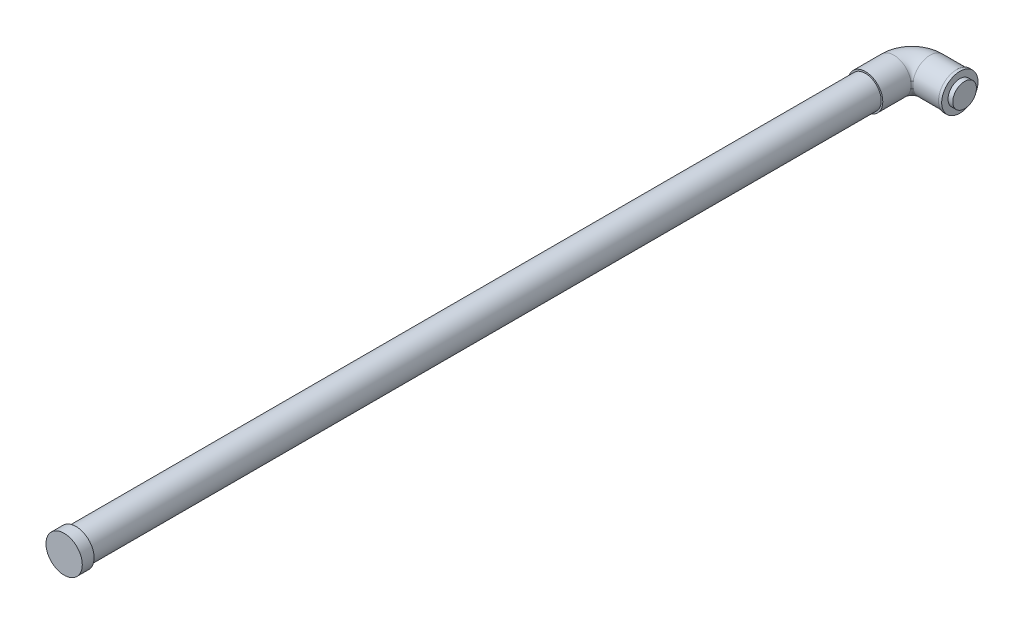
ISO-10303-21;
HEADER;
FILE_DESCRIPTION(('STEP AP214'),'2;1');
FILE_NAME('part.step','',(''),(''),'','','');
FILE_SCHEMA(('AUTOMOTIVE_DESIGN { 1 0 10303 214 1 1 1 1 }'));
ENDSEC;
DATA;
#1=APPLICATION_CONTEXT('core data for automotive mechanical design processes');
#2=APPLICATION_PROTOCOL_DEFINITION('international standard','automotive_design',2000,#1);
#3=PRODUCT_CONTEXT('',#1,'mechanical');
#4=PRODUCT('Part','Part','',(#3));
#5=PRODUCT_RELATED_PRODUCT_CATEGORY('part','',(#4));
#6=PRODUCT_DEFINITION_FORMATION('','',#4);
#7=PRODUCT_DEFINITION_CONTEXT('part definition',#1,'design');
#8=PRODUCT_DEFINITION('design','',#6,#7);
#9=PRODUCT_DEFINITION_SHAPE('','',#8);
#10=(LENGTH_UNIT() NAMED_UNIT(*) SI_UNIT(.MILLI.,.METRE.));
#11=(NAMED_UNIT(*) PLANE_ANGLE_UNIT() SI_UNIT($,.RADIAN.));
#12=(NAMED_UNIT(*) SI_UNIT($,.STERADIAN.) SOLID_ANGLE_UNIT());
#13=UNCERTAINTY_MEASURE_WITH_UNIT(LENGTH_MEASURE(1.E-05),#10,'distance_accuracy_value','');
#14=(GEOMETRIC_REPRESENTATION_CONTEXT(3) GLOBAL_UNCERTAINTY_ASSIGNED_CONTEXT((#13)) GLOBAL_UNIT_ASSIGNED_CONTEXT((#10,
#11,#12)) REPRESENTATION_CONTEXT('',''));
#15=CARTESIAN_POINT('',(0.,0.,0.));
#16=DIRECTION('',(0.,0.,1.));
#17=DIRECTION('',(1.,0.,0.));
#18=AXIS2_PLACEMENT_3D('',#15,#16,#17);
#19=CARTESIAN_POINT('',(-112.299146126032,0.,-73.9808317472687));
#20=DIRECTION('',(0.,0.,-1.));
#21=DIRECTION('',(-1.,0.,0.));
#22=AXIS2_PLACEMENT_3D('',#19,#20,#21);
#23=CYLINDRICAL_SURFACE('',#22,11.);
#24=CARTESIAN_POINT('',(-112.299146126032,0.,-84.4808317472686));
#25=DIRECTION('',(0.,0.,1.));
#26=DIRECTION('',(1.,0.,0.));
#27=AXIS2_PLACEMENT_3D('',#24,#25,#26);
#28=CIRCLE('',#27,11.);
#29=CARTESIAN_POINT('',(-123.299146126032,0.,-84.4808317472686));
#30=VERTEX_POINT('',#29);
#31=EDGE_CURVE('E49',#30,#30,#28,.T.);
#32=ORIENTED_EDGE('',*,*,#31,.T.);
#33=EDGE_LOOP('',(#32));
#34=FACE_BOUND('',#33,.T.);
#35=CARTESIAN_POINT('',(-112.299146126032,0.,-66.4808317472687));
#36=DIRECTION('',(0.,0.,1.));
#37=DIRECTION('',(1.,0.,0.));
#38=AXIS2_PLACEMENT_3D('',#35,#36,#37);
#39=CIRCLE('',#38,11.);
#40=CARTESIAN_POINT('',(-101.299146126032,0.,-66.4808317472687));
#41=VERTEX_POINT('',#40);
#42=EDGE_CURVE('E53',#41,#41,#39,.T.);
#43=ORIENTED_EDGE('',*,*,#42,.F.);
#44=EDGE_LOOP('',(#43));
#45=FACE_BOUND('',#44,.T.);
#46=ADVANCED_FACE('F42',(#34,#45),#23,.T.);
#47=CARTESIAN_POINT('',(-100.799146126032,0.,-84.4808317472686));
#48=DIRECTION('',(0.,-1.,0.));
#49=DIRECTION('',(0.,0.,-1.));
#50=AXIS2_PLACEMENT_3D('',#47,#48,#49);
#51=TOROIDAL_SURFACE('',#50,11.5,11.);
#52=CARTESIAN_POINT('',(-100.799146126032,0.,-95.9808317472686));
#53=DIRECTION('',(-1.,0.,0.));
#54=DIRECTION('',(0.,0.,1.));
#55=AXIS2_PLACEMENT_3D('',#52,#53,#54);
#56=CIRCLE('',#55,11.);
#57=CARTESIAN_POINT('',(-100.799146126032,0.,-106.980831747269));
#58=VERTEX_POINT('',#57);
#59=EDGE_CURVE('E11',#58,#58,#56,.T.);
#60=CARTESIAN_POINT('',(-100.799146126032,0.,-84.4808317472686));
#61=DIRECTION('',(0.,-1.,0.));
#62=DIRECTION('',(0.,0.,-1.));
#63=AXIS2_PLACEMENT_3D('',#60,#61,#62);
#64=CIRCLE('',#63,22.5);
#65=EDGE_CURVE('',#30,#58,#64,.T.);
#66=ORIENTED_EDGE('',*,*,#31,.F.);
#67=ORIENTED_EDGE('',*,*,#59,.T.);
#68=ORIENTED_EDGE('',*,*,#65,.T.);
#69=ORIENTED_EDGE('',*,*,#65,.F.);
#70=EDGE_LOOP('',(#66,#68,#67,#69));
#71=FACE_BOUND('',#70,.T.);
#72=ADVANCED_FACE('F121',(#71),#51,.T.);
#73=CARTESIAN_POINT('',(-100.799146126032,0.,-95.9808317472686));
#74=DIRECTION('',(1.,0.,0.));
#75=DIRECTION('',(0.,0.,-1.));
#76=AXIS2_PLACEMENT_3D('',#73,#74,#75);
#77=CYLINDRICAL_SURFACE('',#76,11.);
#78=CARTESIAN_POINT('',(-83.9991461260318,0.,-95.9808317472686));
#79=DIRECTION('',(1.,0.,0.));
#80=DIRECTION('',(0.,0.,-1.));
#81=AXIS2_PLACEMENT_3D('',#78,#79,#80);
#82=CIRCLE('',#81,11.);
#83=CARTESIAN_POINT('',(-83.9991461260318,0.,-106.980831747269));
#84=VERTEX_POINT('',#83);
#85=EDGE_CURVE('E57',#84,#84,#82,.T.);
#86=ORIENTED_EDGE('',*,*,#85,.F.);
#87=EDGE_LOOP('',(#86));
#88=FACE_BOUND('',#87,.T.);
#89=ORIENTED_EDGE('',*,*,#59,.F.);
#90=EDGE_LOOP('',(#89));
#91=FACE_BOUND('',#90,.T.);
#92=ADVANCED_FACE('F44',(#88,#91),#77,.T.);
#93=CARTESIAN_POINT('',(-112.299146126032,0.,-66.4808317472687));
#94=DIRECTION('',(0.,0.,1.));
#95=DIRECTION('',(1.,0.,0.));
#96=AXIS2_PLACEMENT_3D('',#93,#94,#95);
#97=PLANE('',#96);
#98=CARTESIAN_POINT('',(-112.299146126032,0.,-66.4808317472687));
#99=DIRECTION('',(0.,0.,1.));
#100=DIRECTION('',(1.,0.,0.));
#101=AXIS2_PLACEMENT_3D('',#98,#99,#100);
#102=CIRCLE('',#101,9.99999999999999);
#103=CARTESIAN_POINT('',(-102.299146126032,0.,-66.4808317472687));
#104=VERTEX_POINT('',#103);
#105=EDGE_CURVE('E69',#104,#104,#102,.T.);
#106=ORIENTED_EDGE('',*,*,#105,.F.);
#107=EDGE_LOOP('',(#106));
#108=FACE_BOUND('',#107,.T.);
#109=ORIENTED_EDGE('',*,*,#42,.T.);
#110=EDGE_LOOP('',(#109));
#111=FACE_BOUND('',#110,.T.);
#112=ADVANCED_FACE('F106',(#108,#111),#97,.T.);
#113=CARTESIAN_POINT('',(-81.9991461260318,0.,-95.9808317472686));
#114=DIRECTION('',(-1.,0.,0.));
#115=DIRECTION('',(0.,0.,1.));
#116=AXIS2_PLACEMENT_3D('',#113,#114,#115);
#117=CYLINDRICAL_SURFACE('',#116,11.5);
#118=CARTESIAN_POINT('',(-81.9991461260318,0.,-95.9808317472686));
#119=DIRECTION('',(1.,0.,0.));
#120=DIRECTION('',(0.,0.,-1.));
#121=AXIS2_PLACEMENT_3D('',#118,#119,#120);
#122=CIRCLE('',#121,11.5);
#123=CARTESIAN_POINT('',(-81.9991461260318,0.,-107.480831747269));
#124=VERTEX_POINT('',#123);
#125=EDGE_CURVE('E62',#124,#124,#122,.T.);
#126=ORIENTED_EDGE('',*,*,#125,.F.);
#127=EDGE_LOOP('',(#126));
#128=FACE_BOUND('',#127,.T.);
#129=CARTESIAN_POINT('',(-83.9991461260318,0.,-95.9808317472686));
#130=DIRECTION('',(1.,0.,0.));
#131=DIRECTION('',(0.,0.,-1.));
#132=AXIS2_PLACEMENT_3D('',#129,#130,#131);
#133=CIRCLE('',#132,11.5);
#134=CARTESIAN_POINT('',(-83.9991461260318,0.,-107.480831747269));
#135=VERTEX_POINT('',#134);
#136=EDGE_CURVE('E63',#135,#135,#133,.T.);
#137=ORIENTED_EDGE('',*,*,#136,.T.);
#138=EDGE_LOOP('',(#137));
#139=FACE_BOUND('',#138,.T.);
#140=ADVANCED_FACE('F100',(#128,#139),#117,.T.);
#141=CARTESIAN_POINT('',(-81.9991461260318,0.,-95.9808317472686));
#142=DIRECTION('',(1.,0.,0.));
#143=DIRECTION('',(0.,0.,-1.));
#144=AXIS2_PLACEMENT_3D('',#141,#142,#143);
#145=PLANE('',#144);
#146=CARTESIAN_POINT('',(-81.9991461260318,0.,-95.9808317472686));
#147=DIRECTION('',(1.,0.,0.));
#148=DIRECTION('',(0.,0.,-1.));
#149=AXIS2_PLACEMENT_3D('',#146,#147,#148);
#150=CIRCLE('',#149,7.5);
#151=CARTESIAN_POINT('',(-81.9991461260318,0.,-103.480831747269));
#152=VERTEX_POINT('',#151);
#153=EDGE_CURVE('E81',#152,#152,#150,.T.);
#154=ORIENTED_EDGE('',*,*,#153,.F.);
#155=EDGE_LOOP('',(#154));
#156=FACE_BOUND('',#155,.T.);
#157=ORIENTED_EDGE('',*,*,#125,.T.);
#158=EDGE_LOOP('',(#157));
#159=FACE_BOUND('',#158,.T.);
#160=ADVANCED_FACE('F96',(#156,#159),#145,.T.);
#161=CARTESIAN_POINT('',(-83.9991461260318,0.,-95.9808317472686));
#162=DIRECTION('',(1.,0.,0.));
#163=DIRECTION('',(0.,0.,-1.));
#164=AXIS2_PLACEMENT_3D('',#161,#162,#163);
#165=PLANE('',#164);
#166=ORIENTED_EDGE('',*,*,#85,.T.);
#167=EDGE_LOOP('',(#166));
#168=FACE_BOUND('',#167,.T.);
#169=ORIENTED_EDGE('',*,*,#136,.F.);
#170=EDGE_LOOP('',(#169));
#171=FACE_BOUND('',#170,.T.);
#172=ADVANCED_FACE('F99',(#168,#171),#165,.F.);
#173=CARTESIAN_POINT('',(-112.299146126032,0.,433.519168252731));
#174=DIRECTION('',(0.,0.,-1.));
#175=DIRECTION('',(-1.,0.,0.));
#176=AXIS2_PLACEMENT_3D('',#173,#174,#175);
#177=CYLINDRICAL_SURFACE('',#176,9.99999999999999);
#178=CARTESIAN_POINT('',(-112.299146126032,0.,433.519168252731));
#179=DIRECTION('',(0.,0.,1.));
#180=DIRECTION('',(1.,0.,0.));
#181=AXIS2_PLACEMENT_3D('',#178,#179,#180);
#182=CIRCLE('',#181,9.99999999999999);
#183=CARTESIAN_POINT('',(-102.299146126032,0.,433.519168252731));
#184=VERTEX_POINT('',#183);
#185=EDGE_CURVE('E66',#184,#184,#182,.T.);
#186=ORIENTED_EDGE('',*,*,#185,.F.);
#187=EDGE_LOOP('',(#186));
#188=FACE_BOUND('',#187,.T.);
#189=ORIENTED_EDGE('',*,*,#105,.T.);
#190=EDGE_LOOP('',(#189));
#191=FACE_BOUND('',#190,.T.);
#192=ADVANCED_FACE('F111',(#188,#191),#177,.T.);
#193=CARTESIAN_POINT('',(-112.299146126032,0.,441.019168252731));
#194=DIRECTION('',(0.,0.,-1.));
#195=DIRECTION('',(-1.,0.,0.));
#196=AXIS2_PLACEMENT_3D('',#193,#194,#195);
#197=CYLINDRICAL_SURFACE('',#196,11.5);
#198=CARTESIAN_POINT('',(-112.299146126032,0.,441.019168252731));
#199=DIRECTION('',(0.,0.,1.));
#200=DIRECTION('',(1.,0.,0.));
#201=AXIS2_PLACEMENT_3D('',#198,#199,#200);
#202=CIRCLE('',#201,11.5);
#203=CARTESIAN_POINT('',(-100.799146126032,0.,441.019168252731));
#204=VERTEX_POINT('',#203);
#205=EDGE_CURVE('E72',#204,#204,#202,.T.);
#206=ORIENTED_EDGE('',*,*,#205,.F.);
#207=EDGE_LOOP('',(#206));
#208=FACE_BOUND('',#207,.T.);
#209=CARTESIAN_POINT('',(-112.299146126032,0.,433.519168252731));
#210=DIRECTION('',(0.,0.,1.));
#211=DIRECTION('',(1.,0.,0.));
#212=AXIS2_PLACEMENT_3D('',#209,#210,#211);
#213=CIRCLE('',#212,11.5);
#214=CARTESIAN_POINT('',(-100.799146126032,0.,433.519168252731));
#215=VERTEX_POINT('',#214);
#216=EDGE_CURVE('E75',#215,#215,#213,.T.);
#217=ORIENTED_EDGE('',*,*,#216,.T.);
#218=EDGE_LOOP('',(#217));
#219=FACE_BOUND('',#218,.T.);
#220=ADVANCED_FACE('F117',(#208,#219),#197,.T.);
#221=CARTESIAN_POINT('',(-112.299146126032,0.,441.019168252731));
#222=DIRECTION('',(0.,0.,1.));
#223=DIRECTION('',(1.,0.,0.));
#224=AXIS2_PLACEMENT_3D('',#221,#222,#223);
#225=PLANE('',#224);
#226=ORIENTED_EDGE('',*,*,#205,.T.);
#227=EDGE_LOOP('',(#226));
#228=FACE_BOUND('',#227,.T.);
#229=ADVANCED_FACE('F180',(#228),#225,.T.);
#230=CARTESIAN_POINT('',(-112.299146126032,0.,433.519168252731));
#231=DIRECTION('',(0.,0.,1.));
#232=DIRECTION('',(1.,0.,0.));
#233=AXIS2_PLACEMENT_3D('',#230,#231,#232);
#234=PLANE('',#233);
#235=ORIENTED_EDGE('',*,*,#185,.T.);
#236=EDGE_LOOP('',(#235));
#237=FACE_BOUND('',#236,.T.);
#238=ORIENTED_EDGE('',*,*,#216,.F.);
#239=EDGE_LOOP('',(#238));
#240=FACE_BOUND('',#239,.T.);
#241=ADVANCED_FACE('F92',(#237,#240),#234,.F.);
#242=CARTESIAN_POINT('',(-78.9991461260318,0.,-95.9808317472686));
#243=DIRECTION('',(-1.,0.,0.));
#244=DIRECTION('',(0.,0.,1.));
#245=AXIS2_PLACEMENT_3D('',#242,#243,#244);
#246=CYLINDRICAL_SURFACE('',#245,7.5);
#247=CARTESIAN_POINT('',(-78.9991461260318,0.,-95.9808317472686));
#248=DIRECTION('',(1.,0.,0.));
#249=DIRECTION('',(0.,0.,-1.));
#250=AXIS2_PLACEMENT_3D('',#247,#248,#249);
#251=CIRCLE('',#250,7.5);
#252=CARTESIAN_POINT('',(-78.9991461260318,0.,-103.480831747269));
#253=VERTEX_POINT('',#252);
#254=EDGE_CURVE('E78',#253,#253,#251,.T.);
#255=ORIENTED_EDGE('',*,*,#254,.F.);
#256=EDGE_LOOP('',(#255));
#257=FACE_BOUND('',#256,.T.);
#258=ORIENTED_EDGE('',*,*,#153,.T.);
#259=EDGE_LOOP('',(#258));
#260=FACE_BOUND('',#259,.T.);
#261=ADVANCED_FACE('F89',(#257,#260),#246,.T.);
#262=CARTESIAN_POINT('',(-78.9991461260318,0.,-95.9808317472686));
#263=DIRECTION('',(1.,0.,0.));
#264=DIRECTION('',(0.,0.,-1.));
#265=AXIS2_PLACEMENT_3D('',#262,#263,#264);
#266=PLANE('',#265);
#267=ORIENTED_EDGE('',*,*,#254,.T.);
#268=EDGE_LOOP('',(#267));
#269=FACE_BOUND('',#268,.T.);
#270=ADVANCED_FACE('F87',(#269),#266,.T.);
#271=CLOSED_SHELL('',(#46,#72,#92,#112,#140,#160,#172,#192,#220,#229,#241,#261,#270));
#272=MANIFOLD_SOLID_BREP('B2',#271);
#273=ADVANCED_BREP_SHAPE_REPRESENTATION('',(#18,#272),#14);
#274=SHAPE_DEFINITION_REPRESENTATION(#9,#273);
ENDSEC;
END-ISO-10303-21;
